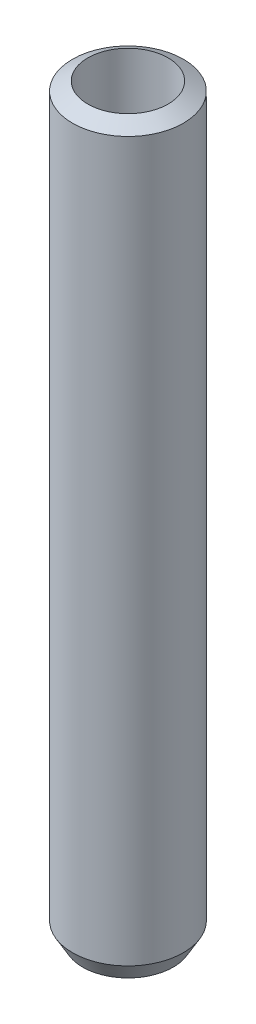
ISO-10303-21;
HEADER;
FILE_DESCRIPTION(('STEP AP214'),'2;1');
FILE_NAME('part.step','',(''),(''),'','','');
FILE_SCHEMA(('AUTOMOTIVE_DESIGN { 1 0 10303 214 1 1 1 1 }'));
ENDSEC;
DATA;
#1=APPLICATION_CONTEXT('core data for automotive mechanical design processes');
#2=APPLICATION_PROTOCOL_DEFINITION('international standard','automotive_design',2000,#1);
#3=PRODUCT_CONTEXT('',#1,'mechanical');
#4=PRODUCT('Part','Part','',(#3));
#5=PRODUCT_RELATED_PRODUCT_CATEGORY('part','',(#4));
#6=PRODUCT_DEFINITION_FORMATION('','',#4);
#7=PRODUCT_DEFINITION_CONTEXT('part definition',#1,'design');
#8=PRODUCT_DEFINITION('design','',#6,#7);
#9=PRODUCT_DEFINITION_SHAPE('','',#8);
#10=(LENGTH_UNIT() NAMED_UNIT(*) SI_UNIT(.MILLI.,.METRE.));
#11=(NAMED_UNIT(*) PLANE_ANGLE_UNIT() SI_UNIT($,.RADIAN.));
#12=(NAMED_UNIT(*) SI_UNIT($,.STERADIAN.) SOLID_ANGLE_UNIT());
#13=UNCERTAINTY_MEASURE_WITH_UNIT(LENGTH_MEASURE(1.E-05),#10,'distance_accuracy_value','');
#14=(GEOMETRIC_REPRESENTATION_CONTEXT(3) GLOBAL_UNCERTAINTY_ASSIGNED_CONTEXT((#13)) GLOBAL_UNIT_ASSIGNED_CONTEXT((#10,
#11,#12)) REPRESENTATION_CONTEXT('',''));
#15=CARTESIAN_POINT('',(0.,0.,0.));
#16=DIRECTION('',(0.,0.,1.));
#17=DIRECTION('',(1.,0.,0.));
#18=AXIS2_PLACEMENT_3D('',#15,#16,#17);
#19=CARTESIAN_POINT('',(0.,336.383450676632,0.));
#20=DIRECTION('',(0.,-1.,0.));
#21=DIRECTION('',(0.,0.,-1.));
#22=AXIS2_PLACEMENT_3D('',#19,#20,#21);
#23=CYLINDRICAL_SURFACE('',#22,25.);
#24=CARTESIAN_POINT('',(0.,331.791387820684,0.));
#25=DIRECTION('',(0.,1.,0.));
#26=DIRECTION('',(0.,0.,1.));
#27=AXIS2_PLACEMENT_3D('',#24,#25,#26);
#28=CIRCLE('',#27,25.);
#29=CARTESIAN_POINT('',(0.,331.791387820684,25.));
#30=VERTEX_POINT('',#29);
#31=EDGE_CURVE('E50',#30,#30,#28,.F.);
#32=ORIENTED_EDGE('',*,*,#31,.T.);
#33=EDGE_LOOP('',(#32));
#34=FACE_BOUND('',#33,.T.);
#35=CARTESIAN_POINT('',(0.,7.95368617805275,0.));
#36=DIRECTION('',(0.,1.,0.));
#37=DIRECTION('',(0.,0.,1.));
#38=AXIS2_PLACEMENT_3D('',#35,#36,#37);
#39=CIRCLE('',#38,25.);
#40=CARTESIAN_POINT('',(0.,7.95368617805275,25.));
#41=VERTEX_POINT('',#40);
#42=EDGE_CURVE('E51',#41,#41,#39,.T.);
#43=ORIENTED_EDGE('',*,*,#42,.T.);
#44=EDGE_LOOP('',(#43));
#45=FACE_BOUND('',#44,.T.);
#46=ADVANCED_FACE('F39',(#34,#45),#23,.T.);
#47=CARTESIAN_POINT('',(0.,0.,0.));
#48=DIRECTION('',(0.,1.,0.));
#49=DIRECTION('',(0.,0.,1.));
#50=AXIS2_PLACEMENT_3D('',#47,#48,#49);
#51=PLANE('',#50);
#52=CARTESIAN_POINT('',(0.,0.,0.));
#53=DIRECTION('',(0.,1.,0.));
#54=DIRECTION('',(0.,0.,1.));
#55=AXIS2_PLACEMENT_3D('',#52,#53,#54);
#56=CIRCLE('',#55,20.4079371440514);
#57=CARTESIAN_POINT('',(0.,0.,20.4079371440514));
#58=VERTEX_POINT('',#57);
#59=EDGE_CURVE('E10',#58,#58,#56,.F.);
#60=ORIENTED_EDGE('',*,*,#59,.T.);
#61=EDGE_LOOP('',(#60));
#62=FACE_BOUND('',#61,.T.);
#63=CARTESIAN_POINT('',(0.,0.,0.));
#64=DIRECTION('',(0.,1.,0.));
#65=DIRECTION('',(0.,0.,1.));
#66=AXIS2_PLACEMENT_3D('',#63,#64,#65);
#67=CIRCLE('',#66,18.0813628762647);
#68=CARTESIAN_POINT('',(0.,0.,18.0813628762647));
#69=VERTEX_POINT('',#68);
#70=EDGE_CURVE('E58',#69,#69,#67,.T.);
#71=ORIENTED_EDGE('',*,*,#70,.T.);
#72=EDGE_LOOP('',(#71));
#73=FACE_BOUND('',#72,.T.);
#74=ADVANCED_FACE('F62',(#62,#73),#51,.F.);
#75=CARTESIAN_POINT('',(0.,336.383450676632,0.));
#76=DIRECTION('',(0.,-1.,0.));
#77=DIRECTION('',(0.,0.,-1.));
#78=AXIS2_PLACEMENT_3D('',#75,#76,#77);
#79=CYLINDRICAL_SURFACE('',#78,18.0813628762647);
#80=CARTESIAN_POINT('',(0.,335.785864826498,0.));
#81=DIRECTION('',(0.,-1.,0.));
#82=DIRECTION('',(0.,0.,-1.));
#83=AXIS2_PLACEMENT_3D('',#80,#81,#82);
#84=CIRCLE('',#83,18.0813628762647);
#85=CARTESIAN_POINT('',(0.,335.785864826498,-18.0813628762647));
#86=VERTEX_POINT('',#85);
#87=EDGE_CURVE('E54',#86,#86,#84,.F.);
#88=ORIENTED_EDGE('',*,*,#87,.T.);
#89=EDGE_LOOP('',(#88));
#90=FACE_BOUND('',#89,.T.);
#91=ORIENTED_EDGE('',*,*,#70,.F.);
#92=EDGE_LOOP('',(#91));
#93=FACE_BOUND('',#92,.T.);
#94=ADVANCED_FACE('F68',(#90,#93),#79,.F.);
#95=CARTESIAN_POINT('',(0.,336.383450676632,0.));
#96=DIRECTION('',(0.,-1.,0.));
#97=DIRECTION('',(0.,0.,-1.));
#98=AXIS2_PLACEMENT_3D('',#95,#96,#97);
#99=CONICAL_SURFACE('',#98,17.0463138219472,1.0471975511966);
#100=ORIENTED_EDGE('',*,*,#31,.F.);
#101=EDGE_LOOP('',(#100));
#102=FACE_BOUND('',#101,.T.);
#103=ORIENTED_EDGE('',*,*,#87,.F.);
#104=EDGE_LOOP('',(#103));
#105=FACE_BOUND('',#104,.T.);
#106=ADVANCED_FACE('F66',(#102,#105),#99,.T.);
#107=CARTESIAN_POINT('',(0.,7.95368617805275,0.));
#108=DIRECTION('',(0.,1.,0.));
#109=DIRECTION('',(0.,0.,1.));
#110=AXIS2_PLACEMENT_3D('',#107,#108,#109);
#111=CONICAL_SURFACE('',#110,25.,0.523598775598303);
#112=ORIENTED_EDGE('',*,*,#59,.F.);
#113=EDGE_LOOP('',(#112));
#114=FACE_BOUND('',#113,.T.);
#115=ORIENTED_EDGE('',*,*,#42,.F.);
#116=EDGE_LOOP('',(#115));
#117=FACE_BOUND('',#116,.T.);
#118=ADVANCED_FACE('F45',(#114,#117),#111,.T.);
#119=CLOSED_SHELL('',(#46,#74,#94,#106,#118));
#120=MANIFOLD_SOLID_BREP('B2',#119);
#121=ADVANCED_BREP_SHAPE_REPRESENTATION('',(#18,#120),#14);
#122=SHAPE_DEFINITION_REPRESENTATION(#9,#121);
ENDSEC;
END-ISO-10303-21;
